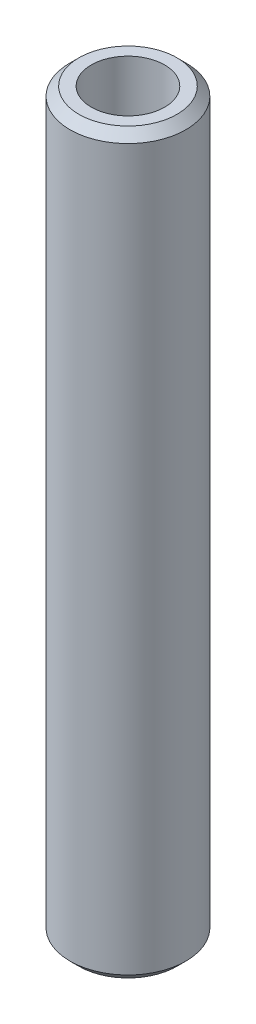
ISO-10303-21;
HEADER;
FILE_DESCRIPTION(('STEP AP214'),'2;1');
FILE_NAME('part.step','',(''),(''),'','','');
FILE_SCHEMA(('AUTOMOTIVE_DESIGN { 1 0 10303 214 1 1 1 1 }'));
ENDSEC;
DATA;
#1=APPLICATION_CONTEXT('core data for automotive mechanical design processes');
#2=APPLICATION_PROTOCOL_DEFINITION('international standard','automotive_design',2000,#1);
#3=PRODUCT_CONTEXT('',#1,'mechanical');
#4=PRODUCT('Part','Part','',(#3));
#5=PRODUCT_RELATED_PRODUCT_CATEGORY('part','',(#4));
#6=PRODUCT_DEFINITION_FORMATION('','',#4);
#7=PRODUCT_DEFINITION_CONTEXT('part definition',#1,'design');
#8=PRODUCT_DEFINITION('design','',#6,#7);
#9=PRODUCT_DEFINITION_SHAPE('','',#8);
#10=(LENGTH_UNIT() NAMED_UNIT(*) SI_UNIT(.MILLI.,.METRE.));
#11=(NAMED_UNIT(*) PLANE_ANGLE_UNIT() SI_UNIT($,.RADIAN.));
#12=(NAMED_UNIT(*) SI_UNIT($,.STERADIAN.) SOLID_ANGLE_UNIT());
#13=UNCERTAINTY_MEASURE_WITH_UNIT(LENGTH_MEASURE(1.E-05),#10,'distance_accuracy_value','');
#14=(GEOMETRIC_REPRESENTATION_CONTEXT(3) GLOBAL_UNCERTAINTY_ASSIGNED_CONTEXT((#13)) GLOBAL_UNIT_ASSIGNED_CONTEXT((#10,
#11,#12)) REPRESENTATION_CONTEXT('',''));
#15=CARTESIAN_POINT('',(0.,0.,0.));
#16=DIRECTION('',(0.,0.,1.));
#17=DIRECTION('',(1.,0.,0.));
#18=AXIS2_PLACEMENT_3D('',#15,#16,#17);
#19=CARTESIAN_POINT('',(0.,445.727306534425,0.));
#20=DIRECTION('',(0.,-1.,0.));
#21=DIRECTION('',(0.,0.,-1.));
#22=AXIS2_PLACEMENT_3D('',#19,#20,#21);
#23=CYLINDRICAL_SURFACE('',#22,35.);
#24=CARTESIAN_POINT('',(0.,440.354817950479,0.));
#25=DIRECTION('',(0.,1.,0.));
#26=DIRECTION('',(0.,0.,1.));
#27=AXIS2_PLACEMENT_3D('',#24,#25,#26);
#28=CIRCLE('',#27,35.);
#29=CARTESIAN_POINT('',(0.,440.354817950479,35.));
#30=VERTEX_POINT('',#29);
#31=EDGE_CURVE('E50',#30,#30,#28,.F.);
#32=ORIENTED_EDGE('',*,*,#31,.T.);
#33=EDGE_LOOP('',(#32));
#34=FACE_BOUND('',#33,.T.);
#35=CARTESIAN_POINT('',(0.,5.37248858394518,0.));
#36=DIRECTION('',(0.,1.,0.));
#37=DIRECTION('',(0.,0.,1.));
#38=AXIS2_PLACEMENT_3D('',#35,#36,#37);
#39=CIRCLE('',#38,35.);
#40=CARTESIAN_POINT('',(0.,5.37248858394518,35.));
#41=VERTEX_POINT('',#40);
#42=EDGE_CURVE('E51',#41,#41,#39,.T.);
#43=ORIENTED_EDGE('',*,*,#42,.T.);
#44=EDGE_LOOP('',(#43));
#45=FACE_BOUND('',#44,.T.);
#46=ADVANCED_FACE('F39',(#34,#45),#23,.T.);
#47=CARTESIAN_POINT('',(0.,445.727306534425,0.));
#48=DIRECTION('',(0.,1.,0.));
#49=DIRECTION('',(0.,0.,1.));
#50=AXIS2_PLACEMENT_3D('',#47,#48,#49);
#51=PLANE('',#50);
#52=CARTESIAN_POINT('',(0.,445.727306534425,0.));
#53=DIRECTION('',(0.,1.,0.));
#54=DIRECTION('',(0.,0.,1.));
#55=AXIS2_PLACEMENT_3D('',#52,#53,#54);
#56=CIRCLE('',#55,29.6275114160548);
#57=CARTESIAN_POINT('',(0.,445.727306534425,29.6275114160548));
#58=VERTEX_POINT('',#57);
#59=EDGE_CURVE('E54',#58,#58,#56,.T.);
#60=ORIENTED_EDGE('',*,*,#59,.T.);
#61=EDGE_LOOP('',(#60));
#62=FACE_BOUND('',#61,.T.);
#63=CARTESIAN_POINT('',(0.,445.727306534425,0.));
#64=DIRECTION('',(0.,1.,0.));
#65=DIRECTION('',(0.,0.,1.));
#66=AXIS2_PLACEMENT_3D('',#63,#64,#65);
#67=CIRCLE('',#66,22.1491693356755);
#68=CARTESIAN_POINT('',(0.,445.727306534425,22.1491693356755));
#69=VERTEX_POINT('',#68);
#70=EDGE_CURVE('E58',#69,#69,#67,.T.);
#71=ORIENTED_EDGE('',*,*,#70,.F.);
#72=EDGE_LOOP('',(#71));
#73=FACE_BOUND('',#72,.T.);
#74=ADVANCED_FACE('F69',(#62,#73),#51,.T.);
#75=CARTESIAN_POINT('',(0.,0.,0.));
#76=DIRECTION('',(0.,1.,0.));
#77=DIRECTION('',(0.,0.,1.));
#78=AXIS2_PLACEMENT_3D('',#75,#76,#77);
#79=PLANE('',#78);
#80=CARTESIAN_POINT('',(0.,0.,0.));
#81=DIRECTION('',(0.,1.,0.));
#82=DIRECTION('',(0.,0.,1.));
#83=AXIS2_PLACEMENT_3D('',#80,#81,#82);
#84=CIRCLE('',#83,29.6275114160548);
#85=CARTESIAN_POINT('',(0.,0.,29.6275114160548));
#86=VERTEX_POINT('',#85);
#87=EDGE_CURVE('E10',#86,#86,#84,.F.);
#88=ORIENTED_EDGE('',*,*,#87,.T.);
#89=EDGE_LOOP('',(#88));
#90=FACE_BOUND('',#89,.T.);
#91=CARTESIAN_POINT('',(0.,0.,0.));
#92=DIRECTION('',(0.,1.,0.));
#93=DIRECTION('',(0.,0.,1.));
#94=AXIS2_PLACEMENT_3D('',#91,#92,#93);
#95=CIRCLE('',#94,22.1491693356755);
#96=CARTESIAN_POINT('',(0.,0.,22.1491693356755));
#97=VERTEX_POINT('',#96);
#98=EDGE_CURVE('E63',#97,#97,#95,.T.);
#99=ORIENTED_EDGE('',*,*,#98,.T.);
#100=EDGE_LOOP('',(#99));
#101=FACE_BOUND('',#100,.T.);
#102=ADVANCED_FACE('F75',(#90,#101),#79,.F.);
#103=CARTESIAN_POINT('',(0.,445.727306534425,0.));
#104=DIRECTION('',(0.,-1.,0.));
#105=DIRECTION('',(0.,0.,-1.));
#106=AXIS2_PLACEMENT_3D('',#103,#104,#105);
#107=CYLINDRICAL_SURFACE('',#106,22.1491693356755);
#108=ORIENTED_EDGE('',*,*,#70,.T.);
#109=EDGE_LOOP('',(#108));
#110=FACE_BOUND('',#109,.T.);
#111=ORIENTED_EDGE('',*,*,#98,.F.);
#112=EDGE_LOOP('',(#111));
#113=FACE_BOUND('',#112,.T.);
#114=ADVANCED_FACE('F70',(#110,#113),#107,.F.);
#115=CARTESIAN_POINT('',(0.,445.727306534425,0.));
#116=DIRECTION('',(0.,-1.,0.));
#117=DIRECTION('',(0.,0.,-1.));
#118=AXIS2_PLACEMENT_3D('',#115,#116,#117);
#119=CONICAL_SURFACE('',#118,29.6275114160548,0.785398163397441);
#120=ORIENTED_EDGE('',*,*,#31,.F.);
#121=EDGE_LOOP('',(#120));
#122=FACE_BOUND('',#121,.T.);
#123=ORIENTED_EDGE('',*,*,#59,.F.);
#124=EDGE_LOOP('',(#123));
#125=FACE_BOUND('',#124,.T.);
#126=ADVANCED_FACE('F81',(#122,#125),#119,.T.);
#127=CARTESIAN_POINT('',(0.,5.37248858394518,0.));
#128=DIRECTION('',(0.,1.,0.));
#129=DIRECTION('',(0.,0.,1.));
#130=AXIS2_PLACEMENT_3D('',#127,#128,#129);
#131=CONICAL_SURFACE('',#130,35.,0.785398163397451);
#132=ORIENTED_EDGE('',*,*,#87,.F.);
#133=EDGE_LOOP('',(#132));
#134=FACE_BOUND('',#133,.T.);
#135=ORIENTED_EDGE('',*,*,#42,.F.);
#136=EDGE_LOOP('',(#135));
#137=FACE_BOUND('',#136,.T.);
#138=ADVANCED_FACE('F45',(#134,#137),#131,.T.);
#139=CLOSED_SHELL('',(#46,#74,#102,#114,#126,#138));
#140=MANIFOLD_SOLID_BREP('B2',#139);
#141=ADVANCED_BREP_SHAPE_REPRESENTATION('',(#18,#140),#14);
#142=SHAPE_DEFINITION_REPRESENTATION(#9,#141);
ENDSEC;
END-ISO-10303-21;
